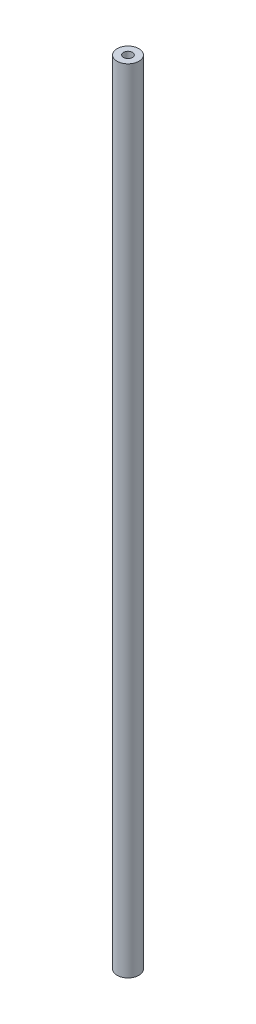
ISO-10303-21;
HEADER;
FILE_DESCRIPTION(('STEP AP214'),'2;1');
FILE_NAME('part.step','',(''),(''),'','','');
FILE_SCHEMA(('AUTOMOTIVE_DESIGN { 1 0 10303 214 1 1 1 1 }'));
ENDSEC;
DATA;
#1=APPLICATION_CONTEXT('core data for automotive mechanical design processes');
#2=APPLICATION_PROTOCOL_DEFINITION('international standard','automotive_design',2000,#1);
#3=PRODUCT_CONTEXT('',#1,'mechanical');
#4=PRODUCT('Part','Part','',(#3));
#5=PRODUCT_RELATED_PRODUCT_CATEGORY('part','',(#4));
#6=PRODUCT_DEFINITION_FORMATION('','',#4);
#7=PRODUCT_DEFINITION_CONTEXT('part definition',#1,'design');
#8=PRODUCT_DEFINITION('design','',#6,#7);
#9=PRODUCT_DEFINITION_SHAPE('','',#8);
#10=(LENGTH_UNIT() NAMED_UNIT(*) SI_UNIT(.MILLI.,.METRE.));
#11=(NAMED_UNIT(*) PLANE_ANGLE_UNIT() SI_UNIT($,.RADIAN.));
#12=(NAMED_UNIT(*) SI_UNIT($,.STERADIAN.) SOLID_ANGLE_UNIT());
#13=UNCERTAINTY_MEASURE_WITH_UNIT(LENGTH_MEASURE(1.E-05),#10,'distance_accuracy_value','');
#14=(GEOMETRIC_REPRESENTATION_CONTEXT(3) GLOBAL_UNCERTAINTY_ASSIGNED_CONTEXT((#13)) GLOBAL_UNIT_ASSIGNED_CONTEXT((#10,
#11,#12)) REPRESENTATION_CONTEXT('',''));
#15=CARTESIAN_POINT('',(0.,0.,0.));
#16=DIRECTION('',(0.,0.,1.));
#17=DIRECTION('',(1.,0.,0.));
#18=AXIS2_PLACEMENT_3D('',#15,#16,#17);
#19=CARTESIAN_POINT('',(0.,290.,0.));
#20=DIRECTION('',(0.,-1.,0.));
#21=DIRECTION('',(0.,0.,-1.));
#22=AXIS2_PLACEMENT_3D('',#19,#20,#21);
#23=CYLINDRICAL_SURFACE('',#22,4.);
#24=CARTESIAN_POINT('',(0.,290.,0.));
#25=DIRECTION('',(0.,1.,0.));
#26=DIRECTION('',(0.,0.,1.));
#27=AXIS2_PLACEMENT_3D('',#24,#25,#26);
#28=CIRCLE('',#27,4.);
#29=CARTESIAN_POINT('',(0.,290.,4.));
#30=VERTEX_POINT('',#29);
#31=EDGE_CURVE('E11',#30,#30,#28,.T.);
#32=ORIENTED_EDGE('',*,*,#31,.F.);
#33=EDGE_LOOP('',(#32));
#34=FACE_BOUND('',#33,.T.);
#35=CARTESIAN_POINT('',(0.,0.,0.));
#36=DIRECTION('',(0.,1.,0.));
#37=DIRECTION('',(0.,0.,1.));
#38=AXIS2_PLACEMENT_3D('',#35,#36,#37);
#39=CIRCLE('',#38,4.);
#40=CARTESIAN_POINT('',(0.,0.,4.));
#41=VERTEX_POINT('',#40);
#42=EDGE_CURVE('E43',#41,#41,#39,.T.);
#43=ORIENTED_EDGE('',*,*,#42,.T.);
#44=EDGE_LOOP('',(#43));
#45=FACE_BOUND('',#44,.T.);
#46=ADVANCED_FACE('F40',(#34,#45),#23,.T.);
#47=CARTESIAN_POINT('',(0.,290.,0.));
#48=DIRECTION('',(0.,1.,0.));
#49=DIRECTION('',(0.,0.,1.));
#50=AXIS2_PLACEMENT_3D('',#47,#48,#49);
#51=PLANE('',#50);
#52=CARTESIAN_POINT('',(0.,290.,0.));
#53=DIRECTION('',(0.,1.,0.));
#54=DIRECTION('',(0.,0.,1.));
#55=AXIS2_PLACEMENT_3D('',#52,#53,#54);
#56=CIRCLE('',#55,1.65);
#57=CARTESIAN_POINT('',(0.,290.,1.65));
#58=VERTEX_POINT('',#57);
#59=EDGE_CURVE('E67',#58,#58,#56,.T.);
#60=ORIENTED_EDGE('',*,*,#59,.F.);
#61=EDGE_LOOP('',(#60));
#62=FACE_BOUND('',#61,.T.);
#63=ORIENTED_EDGE('',*,*,#31,.T.);
#64=EDGE_LOOP('',(#63));
#65=FACE_BOUND('',#64,.T.);
#66=ADVANCED_FACE('F90',(#62,#65),#51,.T.);
#67=CARTESIAN_POINT('',(0.,0.,0.));
#68=DIRECTION('',(0.,1.,0.));
#69=DIRECTION('',(0.,0.,1.));
#70=AXIS2_PLACEMENT_3D('',#67,#68,#69);
#71=PLANE('',#70);
#72=CARTESIAN_POINT('',(0.,0.,0.));
#73=DIRECTION('',(0.,-1.,0.));
#74=DIRECTION('',(0.,0.,-1.));
#75=AXIS2_PLACEMENT_3D('',#72,#73,#74);
#76=CIRCLE('',#75,1.64999999999999);
#77=CARTESIAN_POINT('',(0.,0.,-1.64999999999999));
#78=VERTEX_POINT('',#77);
#79=EDGE_CURVE('E68',#78,#78,#76,.T.);
#80=ORIENTED_EDGE('',*,*,#79,.F.);
#81=EDGE_LOOP('',(#80));
#82=FACE_BOUND('',#81,.T.);
#83=ORIENTED_EDGE('',*,*,#42,.F.);
#84=EDGE_LOOP('',(#83));
#85=FACE_BOUND('',#84,.T.);
#86=ADVANCED_FACE('F87',(#82,#85),#71,.F.);
#87=CARTESIAN_POINT('',(0.,287.6,0.));
#88=DIRECTION('',(0.,1.,0.));
#89=DIRECTION('',(0.,0.,1.));
#90=AXIS2_PLACEMENT_3D('',#87,#88,#89);
#91=CONICAL_SURFACE('',#90,1.65,1.02974425867666);
#92=CARTESIAN_POINT('',(0.,286.608579978604,0.));
#93=VERTEX_POINT('',#92);
#94=VERTEX_LOOP('',#93);
#95=FACE_BOUND('',#94,.T.);
#96=CARTESIAN_POINT('',(0.,287.6,0.));
#97=DIRECTION('',(0.,1.,0.));
#98=DIRECTION('',(0.,0.,1.));
#99=AXIS2_PLACEMENT_3D('',#96,#97,#98);
#100=CIRCLE('',#99,1.65);
#101=CARTESIAN_POINT('',(0.,287.6,1.65));
#102=VERTEX_POINT('',#101);
#103=EDGE_CURVE('E74',#102,#102,#100,.T.);
#104=ORIENTED_EDGE('',*,*,#103,.T.);
#105=EDGE_LOOP('',(#104));
#106=FACE_BOUND('',#105,.T.);
#107=ADVANCED_FACE('F89',(#95,#106),#91,.F.);
#108=CARTESIAN_POINT('',(0.,290.,0.));
#109=DIRECTION('',(0.,1.,0.));
#110=DIRECTION('',(0.,0.,1.));
#111=AXIS2_PLACEMENT_3D('',#108,#109,#110);
#112=CYLINDRICAL_SURFACE('',#111,1.65);
#113=ORIENTED_EDGE('',*,*,#103,.F.);
#114=EDGE_LOOP('',(#113));
#115=FACE_BOUND('',#114,.T.);
#116=ORIENTED_EDGE('',*,*,#59,.T.);
#117=EDGE_LOOP('',(#116));
#118=FACE_BOUND('',#117,.T.);
#119=ADVANCED_FACE('F60',(#115,#118),#112,.F.);
#120=CARTESIAN_POINT('',(0.,2.4,0.));
#121=DIRECTION('',(0.,-1.,0.));
#122=DIRECTION('',(0.,0.,-1.));
#123=AXIS2_PLACEMENT_3D('',#120,#121,#122);
#124=CONICAL_SURFACE('',#123,1.64999999999999,1.02974425867665);
#125=CARTESIAN_POINT('',(0.,3.39142002139547,0.));
#126=VERTEX_POINT('',#125);
#127=VERTEX_LOOP('',#126);
#128=FACE_BOUND('',#127,.T.);
#129=CARTESIAN_POINT('',(0.,2.4,0.));
#130=DIRECTION('',(0.,-1.,0.));
#131=DIRECTION('',(0.,0.,-1.));
#132=AXIS2_PLACEMENT_3D('',#129,#130,#131);
#133=CIRCLE('',#132,1.64999999999999);
#134=CARTESIAN_POINT('',(0.,2.4,-1.64999999999999));
#135=VERTEX_POINT('',#134);
#136=EDGE_CURVE('E64',#135,#135,#133,.T.);
#137=ORIENTED_EDGE('',*,*,#136,.T.);
#138=EDGE_LOOP('',(#137));
#139=FACE_BOUND('',#138,.T.);
#140=ADVANCED_FACE('F56',(#128,#139),#124,.F.);
#141=CARTESIAN_POINT('',(0.,0.,0.));
#142=DIRECTION('',(0.,-1.,0.));
#143=DIRECTION('',(0.,0.,-1.));
#144=AXIS2_PLACEMENT_3D('',#141,#142,#143);
#145=CYLINDRICAL_SURFACE('',#144,1.64999999999999);
#146=ORIENTED_EDGE('',*,*,#136,.F.);
#147=EDGE_LOOP('',(#146));
#148=FACE_BOUND('',#147,.T.);
#149=ORIENTED_EDGE('',*,*,#79,.T.);
#150=EDGE_LOOP('',(#149));
#151=FACE_BOUND('',#150,.T.);
#152=ADVANCED_FACE('F59',(#148,#151),#145,.F.);
#153=CLOSED_SHELL('',(#46,#66,#86,#107,#119,#140,#152));
#154=MANIFOLD_SOLID_BREP('B2',#153);
#155=ADVANCED_BREP_SHAPE_REPRESENTATION('',(#18,#154),#14);
#156=SHAPE_DEFINITION_REPRESENTATION(#9,#155);
ENDSEC;
END-ISO-10303-21;
